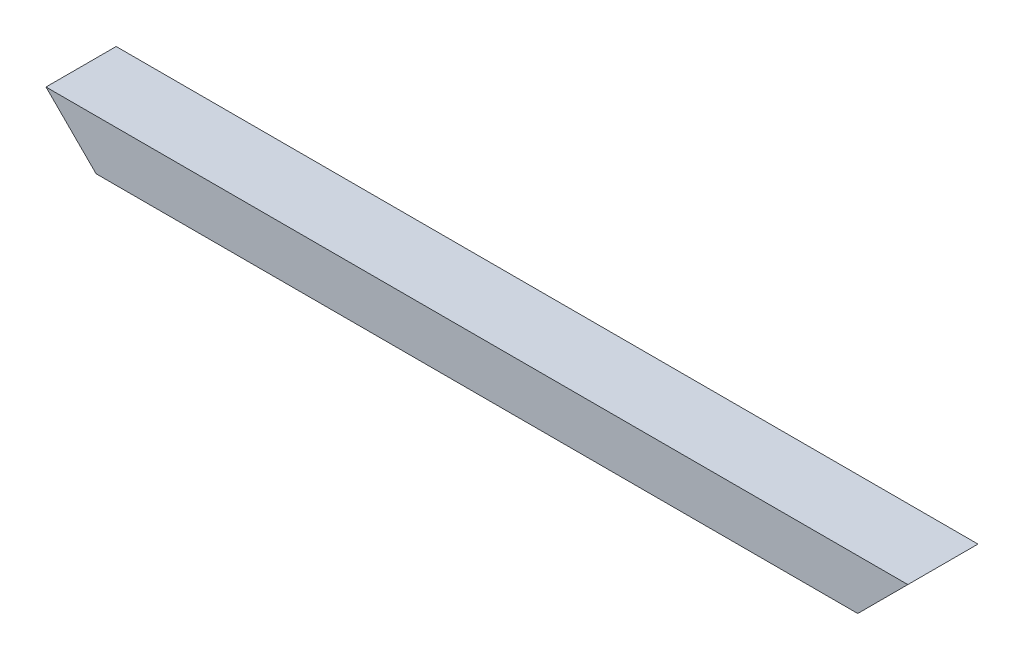
ISO-10303-21;
HEADER;
FILE_DESCRIPTION(('STEP AP214'),'2;1');
FILE_NAME('part.step','',(''),(''),'','','');
FILE_SCHEMA(('AUTOMOTIVE_DESIGN { 1 0 10303 214 1 1 1 1 }'));
ENDSEC;
DATA;
#1=APPLICATION_CONTEXT('core data for automotive mechanical design processes');
#2=APPLICATION_PROTOCOL_DEFINITION('international standard','automotive_design',2000,#1);
#3=PRODUCT_CONTEXT('',#1,'mechanical');
#4=PRODUCT('Part','Part','',(#3));
#5=PRODUCT_RELATED_PRODUCT_CATEGORY('part','',(#4));
#6=PRODUCT_DEFINITION_FORMATION('','',#4);
#7=PRODUCT_DEFINITION_CONTEXT('part definition',#1,'design');
#8=PRODUCT_DEFINITION('design','',#6,#7);
#9=PRODUCT_DEFINITION_SHAPE('','',#8);
#10=(LENGTH_UNIT() NAMED_UNIT(*) SI_UNIT(.MILLI.,.METRE.));
#11=(NAMED_UNIT(*) PLANE_ANGLE_UNIT() SI_UNIT($,.RADIAN.));
#12=(NAMED_UNIT(*) SI_UNIT($,.STERADIAN.) SOLID_ANGLE_UNIT());
#13=UNCERTAINTY_MEASURE_WITH_UNIT(LENGTH_MEASURE(1.E-05),#10,'distance_accuracy_value','');
#14=(GEOMETRIC_REPRESENTATION_CONTEXT(3) GLOBAL_UNCERTAINTY_ASSIGNED_CONTEXT((#13)) GLOBAL_UNIT_ASSIGNED_CONTEXT((#10,
#11,#12)) REPRESENTATION_CONTEXT('',''));
#15=CARTESIAN_POINT('',(0.,0.,0.));
#16=DIRECTION('',(0.,0.,1.));
#17=DIRECTION('',(1.,0.,0.));
#18=AXIS2_PLACEMENT_3D('',#15,#16,#17);
#19=CARTESIAN_POINT('',(-63.5000000000006,63.4999999999999,88.9));
#20=DIRECTION('',(0.707106781186543,0.707106781186552,0.));
#21=DIRECTION('',(-0.707106781186552,0.707106781186543,0.));
#22=AXIS2_PLACEMENT_3D('',#19,#20,#21);
#23=PLANE('',#22);
#24=DIRECTION('',(0.707106781186552,-0.707106781186543,0.));
#25=VECTOR('',#24,1.);
#26=CARTESIAN_POINT('',(-63.5000000000006,63.4999999999999,0.));
#27=LINE('',#26,#25);
#28=CARTESIAN_POINT('',(-63.5000000000006,63.4999999999999,0.));
#29=VERTEX_POINT('',#28);
#30=CARTESIAN_POINT('',(0.,0.,0.));
#31=VERTEX_POINT('',#30);
#32=EDGE_CURVE('E97',#29,#31,#27,.T.);
#33=ORIENTED_EDGE('',*,*,#32,.T.);
#34=DIRECTION('',(0.,0.,-1.));
#35=VECTOR('',#34,1.);
#36=CARTESIAN_POINT('',(0.,0.,88.9));
#37=LINE('',#36,#35);
#38=CARTESIAN_POINT('',(0.,0.,88.9));
#39=VERTEX_POINT('',#38);
#40=EDGE_CURVE('E11',#39,#31,#37,.T.);
#41=ORIENTED_EDGE('',*,*,#40,.F.);
#42=DIRECTION('',(0.707106781186552,-0.707106781186543,0.));
#43=VECTOR('',#42,1.);
#44=CARTESIAN_POINT('',(-63.5000000000006,63.4999999999999,88.9));
#45=LINE('',#44,#43);
#46=CARTESIAN_POINT('',(-63.5000000000006,63.4999999999999,88.9));
#47=VERTEX_POINT('',#46);
#48=EDGE_CURVE('E85',#47,#39,#45,.T.);
#49=ORIENTED_EDGE('',*,*,#48,.F.);
#50=DIRECTION('',(0.,0.,-1.));
#51=VECTOR('',#50,1.);
#52=CARTESIAN_POINT('',(-63.5000000000006,63.4999999999999,88.9));
#53=LINE('',#52,#51);
#54=EDGE_CURVE('E93',#47,#29,#53,.T.);
#55=ORIENTED_EDGE('',*,*,#54,.T.);
#56=EDGE_LOOP('',(#33,#41,#49,#55));
#57=FACE_BOUND('',#56,.T.);
#58=ADVANCED_FACE('F34',(#57),#23,.F.);
#59=CARTESIAN_POINT('',(0.,0.,88.9));
#60=DIRECTION('',(0.,1.,0.));
#61=DIRECTION('',(0.,0.,1.));
#62=AXIS2_PLACEMENT_3D('',#59,#60,#61);
#63=PLANE('',#62);
#64=DIRECTION('',(1.,0.,0.));
#65=VECTOR('',#64,1.);
#66=CARTESIAN_POINT('',(0.,0.,0.));
#67=LINE('',#66,#65);
#68=CARTESIAN_POINT('',(965.2,0.,0.));
#69=VERTEX_POINT('',#68);
#70=EDGE_CURVE('E89',#31,#69,#67,.T.);
#71=ORIENTED_EDGE('',*,*,#70,.T.);
#72=DIRECTION('',(0.,0.,-1.));
#73=VECTOR('',#72,1.);
#74=CARTESIAN_POINT('',(965.2,0.,88.9));
#75=LINE('',#74,#73);
#76=CARTESIAN_POINT('',(965.2,0.,88.9));
#77=VERTEX_POINT('',#76);
#78=EDGE_CURVE('E42',#77,#69,#75,.T.);
#79=ORIENTED_EDGE('',*,*,#78,.F.);
#80=DIRECTION('',(1.,0.,0.));
#81=VECTOR('',#80,1.);
#82=CARTESIAN_POINT('',(0.,0.,88.9));
#83=LINE('',#82,#81);
#84=EDGE_CURVE('E80',#39,#77,#83,.T.);
#85=ORIENTED_EDGE('',*,*,#84,.F.);
#86=ORIENTED_EDGE('',*,*,#40,.T.);
#87=EDGE_LOOP('',(#71,#79,#85,#86));
#88=FACE_BOUND('',#87,.T.);
#89=ADVANCED_FACE('F88',(#88),#63,.F.);
#90=CARTESIAN_POINT('',(965.2,0.,88.9));
#91=DIRECTION('',(-0.707106781186544,0.707106781186551,0.));
#92=DIRECTION('',(-0.707106781186551,-0.707106781186544,0.));
#93=AXIS2_PLACEMENT_3D('',#90,#91,#92);
#94=PLANE('',#93);
#95=DIRECTION('',(0.707106781186551,0.707106781186544,0.));
#96=VECTOR('',#95,1.);
#97=CARTESIAN_POINT('',(965.2,0.,0.));
#98=LINE('',#97,#96);
#99=CARTESIAN_POINT('',(1028.7,63.5,0.));
#100=VERTEX_POINT('',#99);
#101=EDGE_CURVE('E67',#69,#100,#98,.T.);
#102=ORIENTED_EDGE('',*,*,#101,.T.);
#103=DIRECTION('',(0.,0.,-1.));
#104=VECTOR('',#103,1.);
#105=CARTESIAN_POINT('',(1028.7,63.5,88.9));
#106=LINE('',#105,#104);
#107=CARTESIAN_POINT('',(1028.7,63.5,88.9));
#108=VERTEX_POINT('',#107);
#109=EDGE_CURVE('E90',#108,#100,#106,.T.);
#110=ORIENTED_EDGE('',*,*,#109,.F.);
#111=DIRECTION('',(0.707106781186551,0.707106781186544,0.));
#112=VECTOR('',#111,1.);
#113=CARTESIAN_POINT('',(965.2,0.,88.9));
#114=LINE('',#113,#112);
#115=EDGE_CURVE('E83',#77,#108,#114,.T.);
#116=ORIENTED_EDGE('',*,*,#115,.F.);
#117=ORIENTED_EDGE('',*,*,#78,.T.);
#118=EDGE_LOOP('',(#102,#110,#116,#117));
#119=FACE_BOUND('',#118,.T.);
#120=ADVANCED_FACE('F91',(#119),#94,.F.);
#121=CARTESIAN_POINT('',(1028.7,63.5,88.9));
#122=DIRECTION('',(0.,-1.,0.));
#123=DIRECTION('',(1.,0.,0.));
#124=AXIS2_PLACEMENT_3D('',#121,#122,#123);
#125=PLANE('',#124);
#126=DIRECTION('',(-1.,0.,0.));
#127=VECTOR('',#126,1.);
#128=CARTESIAN_POINT('',(1028.7,63.5,0.));
#129=LINE('',#128,#127);
#130=EDGE_CURVE('E73',#100,#29,#129,.T.);
#131=ORIENTED_EDGE('',*,*,#130,.T.);
#132=ORIENTED_EDGE('',*,*,#54,.F.);
#133=DIRECTION('',(-1.,0.,0.));
#134=VECTOR('',#133,1.);
#135=CARTESIAN_POINT('',(1028.7,63.5,88.9));
#136=LINE('',#135,#134);
#137=EDGE_CURVE('E50',#108,#47,#136,.T.);
#138=ORIENTED_EDGE('',*,*,#137,.F.);
#139=ORIENTED_EDGE('',*,*,#109,.T.);
#140=EDGE_LOOP('',(#131,#132,#138,#139));
#141=FACE_BOUND('',#140,.T.);
#142=ADVANCED_FACE('F104',(#141),#125,.F.);
#143=CARTESIAN_POINT('',(0.,0.,88.9));
#144=DIRECTION('',(0.,0.,1.));
#145=DIRECTION('',(1.,0.,0.));
#146=AXIS2_PLACEMENT_3D('',#143,#144,#145);
#147=PLANE('',#146);
#148=ORIENTED_EDGE('',*,*,#48,.T.);
#149=ORIENTED_EDGE('',*,*,#84,.T.);
#150=ORIENTED_EDGE('',*,*,#115,.T.);
#151=ORIENTED_EDGE('',*,*,#137,.T.);
#152=EDGE_LOOP('',(#148,#149,#150,#151));
#153=FACE_BOUND('',#152,.T.);
#154=ADVANCED_FACE('F81',(#153),#147,.T.);
#155=CARTESIAN_POINT('',(0.,0.,0.));
#156=DIRECTION('',(0.,0.,1.));
#157=DIRECTION('',(1.,0.,0.));
#158=AXIS2_PLACEMENT_3D('',#155,#156,#157);
#159=PLANE('',#158);
#160=ORIENTED_EDGE('',*,*,#32,.F.);
#161=ORIENTED_EDGE('',*,*,#130,.F.);
#162=ORIENTED_EDGE('',*,*,#101,.F.);
#163=ORIENTED_EDGE('',*,*,#70,.F.);
#164=EDGE_LOOP('',(#160,#161,#162,#163));
#165=FACE_BOUND('',#164,.T.);
#166=ADVANCED_FACE('F107',(#165),#159,.F.);
#167=CLOSED_SHELL('',(#58,#89,#120,#142,#154,#166));
#168=MANIFOLD_SOLID_BREP('B2',#167);
#169=ADVANCED_BREP_SHAPE_REPRESENTATION('',(#18,#168),#14);
#170=SHAPE_DEFINITION_REPRESENTATION(#9,#169);
ENDSEC;
END-ISO-10303-21;
